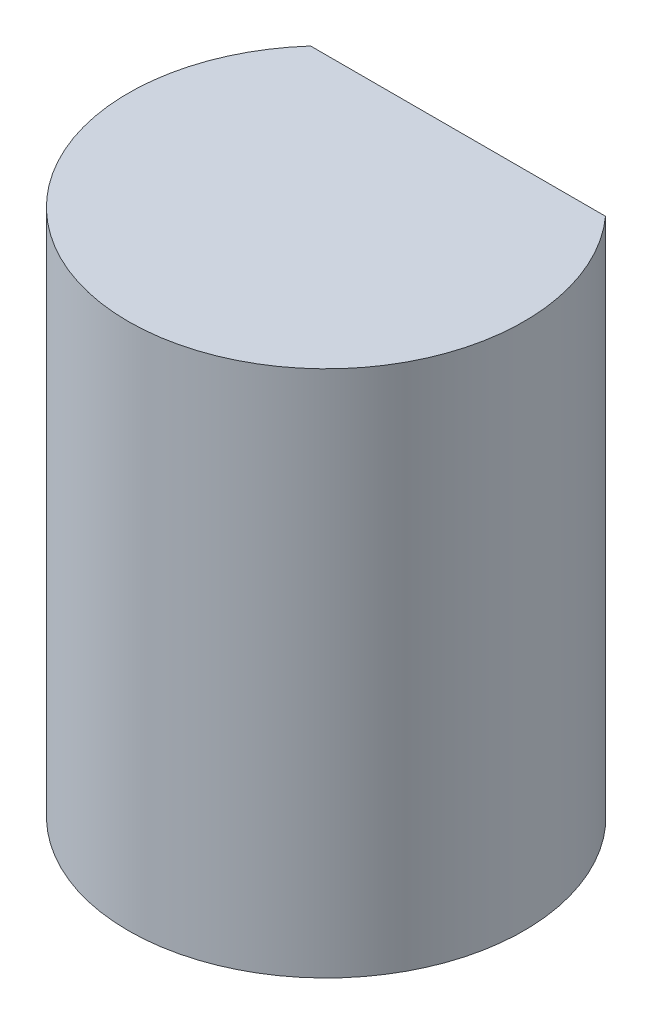
ISO-10303-21;
HEADER;
FILE_DESCRIPTION(('STEP AP214'),'2;1');
FILE_NAME('part.step','',(''),(''),'','','');
FILE_SCHEMA(('AUTOMOTIVE_DESIGN { 1 0 10303 214 1 1 1 1 }'));
ENDSEC;
DATA;
#1=APPLICATION_CONTEXT('core data for automotive mechanical design processes');
#2=APPLICATION_PROTOCOL_DEFINITION('international standard','automotive_design',2000,#1);
#3=PRODUCT_CONTEXT('',#1,'mechanical');
#4=PRODUCT('Part','Part','',(#3));
#5=PRODUCT_RELATED_PRODUCT_CATEGORY('part','',(#4));
#6=PRODUCT_DEFINITION_FORMATION('','',#4);
#7=PRODUCT_DEFINITION_CONTEXT('part definition',#1,'design');
#8=PRODUCT_DEFINITION('design','',#6,#7);
#9=PRODUCT_DEFINITION_SHAPE('','',#8);
#10=(LENGTH_UNIT() NAMED_UNIT(*) SI_UNIT(.MILLI.,.METRE.));
#11=(NAMED_UNIT(*) PLANE_ANGLE_UNIT() SI_UNIT($,.RADIAN.));
#12=(NAMED_UNIT(*) SI_UNIT($,.STERADIAN.) SOLID_ANGLE_UNIT());
#13=UNCERTAINTY_MEASURE_WITH_UNIT(LENGTH_MEASURE(1.E-05),#10,'distance_accuracy_value','');
#14=(GEOMETRIC_REPRESENTATION_CONTEXT(3) GLOBAL_UNCERTAINTY_ASSIGNED_CONTEXT((#13)) GLOBAL_UNIT_ASSIGNED_CONTEXT((#10,
#11,#12)) REPRESENTATION_CONTEXT('',''));
#15=CARTESIAN_POINT('',(0.,0.,0.));
#16=DIRECTION('',(0.,0.,1.));
#17=DIRECTION('',(1.,0.,0.));
#18=AXIS2_PLACEMENT_3D('',#15,#16,#17);
#19=CARTESIAN_POINT('',(0.,4.,0.));
#20=DIRECTION('',(0.,-1.,0.));
#21=DIRECTION('',(0.,0.,-1.));
#22=AXIS2_PLACEMENT_3D('',#19,#20,#21);
#23=CYLINDRICAL_SURFACE('',#22,1.5);
#24=CARTESIAN_POINT('',(0.,4.,0.));
#25=DIRECTION('',(0.,1.,0.));
#26=DIRECTION('',(0.,0.,1.));
#27=AXIS2_PLACEMENT_3D('',#24,#25,#26);
#28=CIRCLE('',#27,1.5);
#29=CARTESIAN_POINT('',(-1.11803398874989,4.,-1.));
#30=VERTEX_POINT('',#29);
#31=CARTESIAN_POINT('',(1.11803398874989,4.,-1.));
#32=VERTEX_POINT('',#31);
#33=EDGE_CURVE('E11',#30,#32,#28,.T.);
#34=ORIENTED_EDGE('',*,*,#33,.F.);
#35=DIRECTION('',(0.,-1.,0.));
#36=VECTOR('',#35,1.);
#37=CARTESIAN_POINT('',(-1.1180339887499,4.,-1.));
#38=LINE('',#37,#36);
#39=CARTESIAN_POINT('',(-1.11803398874989,0.,-1.));
#40=VERTEX_POINT('',#39);
#41=EDGE_CURVE('E58',#40,#30,#38,.F.);
#42=ORIENTED_EDGE('',*,*,#41,.F.);
#43=CARTESIAN_POINT('',(0.,0.,0.));
#44=DIRECTION('',(0.,1.,0.));
#45=DIRECTION('',(0.,0.,1.));
#46=AXIS2_PLACEMENT_3D('',#43,#44,#45);
#47=CIRCLE('',#46,1.5);
#48=CARTESIAN_POINT('',(1.1180339887499,0.,-1.));
#49=VERTEX_POINT('',#48);
#50=EDGE_CURVE('E35',#40,#49,#47,.T.);
#51=ORIENTED_EDGE('',*,*,#50,.T.);
#52=DIRECTION('',(0.,-1.,0.));
#53=VECTOR('',#52,1.);
#54=CARTESIAN_POINT('',(1.1180339887499,4.,-1.));
#55=LINE('',#54,#53);
#56=EDGE_CURVE('E46',#32,#49,#55,.T.);
#57=ORIENTED_EDGE('',*,*,#56,.F.);
#58=EDGE_LOOP('',(#34,#42,#51,#57));
#59=FACE_BOUND('',#58,.T.);
#60=ADVANCED_FACE('F32',(#59),#23,.T.);
#61=CARTESIAN_POINT('',(0.,4.,0.));
#62=DIRECTION('',(0.,1.,0.));
#63=DIRECTION('',(0.,0.,1.));
#64=AXIS2_PLACEMENT_3D('',#61,#62,#63);
#65=PLANE('',#64);
#66=DIRECTION('',(1.,0.,0.));
#67=VECTOR('',#66,1.);
#68=CARTESIAN_POINT('',(-1.11803398874989,4.,-1.));
#69=LINE('',#68,#67);
#70=EDGE_CURVE('E56',#30,#32,#69,.T.);
#71=ORIENTED_EDGE('',*,*,#70,.F.);
#72=ORIENTED_EDGE('',*,*,#33,.T.);
#73=EDGE_LOOP('',(#71,#72));
#74=FACE_BOUND('',#73,.T.);
#75=ADVANCED_FACE('F66',(#74),#65,.T.);
#76=CARTESIAN_POINT('',(0.,0.,0.));
#77=DIRECTION('',(0.,1.,0.));
#78=DIRECTION('',(0.,0.,1.));
#79=AXIS2_PLACEMENT_3D('',#76,#77,#78);
#80=PLANE('',#79);
#81=ORIENTED_EDGE('',*,*,#50,.F.);
#82=DIRECTION('',(-1.,0.,0.));
#83=VECTOR('',#82,1.);
#84=CARTESIAN_POINT('',(-1.11803398874989,0.,-1.));
#85=LINE('',#84,#83);
#86=EDGE_CURVE('E50',#49,#40,#85,.T.);
#87=ORIENTED_EDGE('',*,*,#86,.F.);
#88=EDGE_LOOP('',(#81,#87));
#89=FACE_BOUND('',#88,.T.);
#90=ADVANCED_FACE('F68',(#89),#80,.F.);
#91=CARTESIAN_POINT('',(-1.11803398874989,-0.00100000000000013,-1.));
#92=DIRECTION('',(0.,0.,1.));
#93=DIRECTION('',(1.,0.,0.));
#94=AXIS2_PLACEMENT_3D('',#91,#92,#93);
#95=PLANE('',#94);
#96=ORIENTED_EDGE('',*,*,#86,.T.);
#97=ORIENTED_EDGE('',*,*,#41,.T.);
#98=ORIENTED_EDGE('',*,*,#70,.T.);
#99=ORIENTED_EDGE('',*,*,#56,.T.);
#100=EDGE_LOOP('',(#96,#97,#98,#99));
#101=FACE_BOUND('',#100,.T.);
#102=ADVANCED_FACE('F57',(#101),#95,.F.);
#103=CLOSED_SHELL('',(#60,#75,#90,#102));
#104=MANIFOLD_SOLID_BREP('B2',#103);
#105=ADVANCED_BREP_SHAPE_REPRESENTATION('',(#18,#104),#14);
#106=SHAPE_DEFINITION_REPRESENTATION(#9,#105);
ENDSEC;
END-ISO-10303-21;
